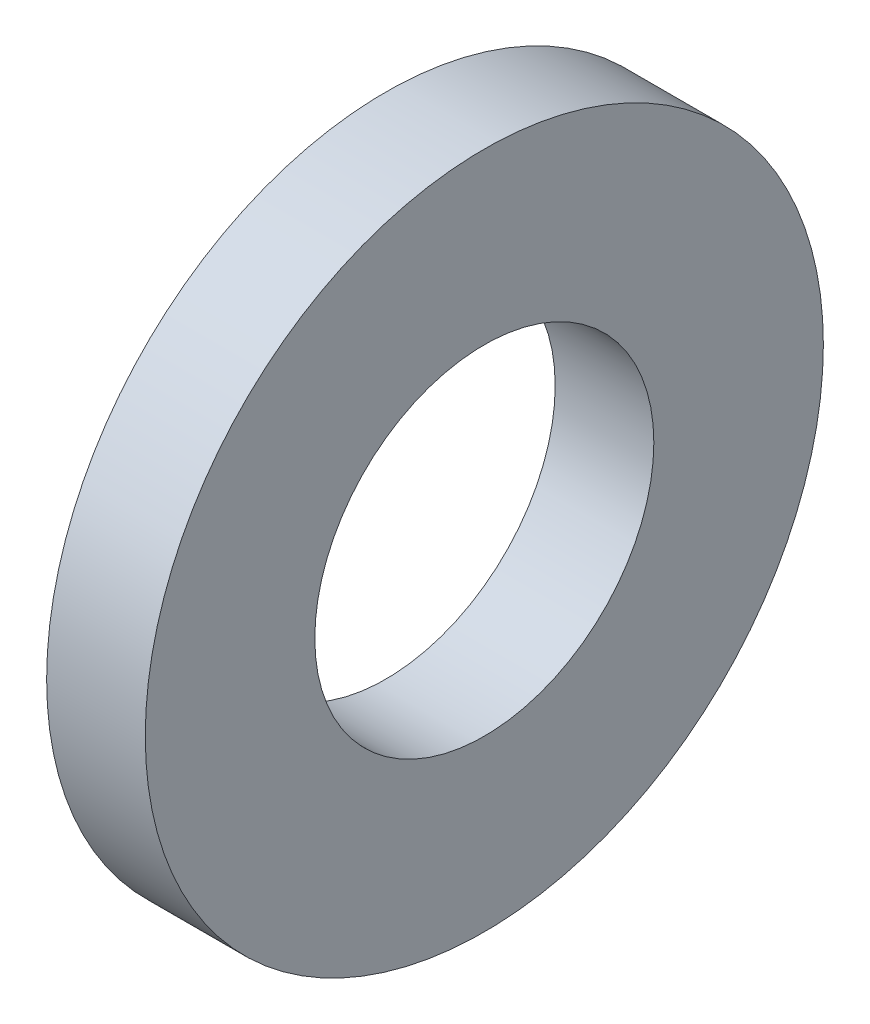
ISO-10303-21;
HEADER;
FILE_DESCRIPTION(('STEP AP214'),'2;1');
FILE_NAME('part.step','',(''),(''),'','','');
FILE_SCHEMA(('AUTOMOTIVE_DESIGN { 1 0 10303 214 1 1 1 1 }'));
ENDSEC;
DATA;
#1=APPLICATION_CONTEXT('core data for automotive mechanical design processes');
#2=APPLICATION_PROTOCOL_DEFINITION('international standard','automotive_design',2000,#1);
#3=PRODUCT_CONTEXT('',#1,'mechanical');
#4=PRODUCT('Part','Part','',(#3));
#5=PRODUCT_RELATED_PRODUCT_CATEGORY('part','',(#4));
#6=PRODUCT_DEFINITION_FORMATION('','',#4);
#7=PRODUCT_DEFINITION_CONTEXT('part definition',#1,'design');
#8=PRODUCT_DEFINITION('design','',#6,#7);
#9=PRODUCT_DEFINITION_SHAPE('','',#8);
#10=(LENGTH_UNIT() NAMED_UNIT(*) SI_UNIT(.MILLI.,.METRE.));
#11=(NAMED_UNIT(*) PLANE_ANGLE_UNIT() SI_UNIT($,.RADIAN.));
#12=(NAMED_UNIT(*) SI_UNIT($,.STERADIAN.) SOLID_ANGLE_UNIT());
#13=UNCERTAINTY_MEASURE_WITH_UNIT(LENGTH_MEASURE(1.E-05),#10,'distance_accuracy_value','');
#14=(GEOMETRIC_REPRESENTATION_CONTEXT(3) GLOBAL_UNCERTAINTY_ASSIGNED_CONTEXT((#13)) GLOBAL_UNIT_ASSIGNED_CONTEXT((#10,
#11,#12)) REPRESENTATION_CONTEXT('',''));
#15=CARTESIAN_POINT('',(0.,0.,0.));
#16=DIRECTION('',(0.,0.,1.));
#17=DIRECTION('',(1.,0.,0.));
#18=AXIS2_PLACEMENT_3D('',#15,#16,#17);
#19=CARTESIAN_POINT('',(1.6,0.,0.));
#20=DIRECTION('',(1.,0.,0.));
#21=DIRECTION('',(0.,0.,-1.));
#22=AXIS2_PLACEMENT_3D('',#19,#20,#21);
#23=PLANE('',#22);
#24=CARTESIAN_POINT('',(1.6,0.,0.));
#25=DIRECTION('',(1.,0.,0.));
#26=DIRECTION('',(0.,0.,-1.));
#27=AXIS2_PLACEMENT_3D('',#24,#25,#26);
#28=CIRCLE('',#27,5.5);
#29=CARTESIAN_POINT('',(1.6,0.,-5.5));
#30=VERTEX_POINT('',#29);
#31=EDGE_CURVE('E10',#30,#30,#28,.T.);
#32=ORIENTED_EDGE('',*,*,#31,.T.);
#33=EDGE_LOOP('',(#32));
#34=FACE_BOUND('',#33,.T.);
#35=CARTESIAN_POINT('',(1.6,0.,0.));
#36=DIRECTION('',(1.,0.,0.));
#37=DIRECTION('',(0.,0.,-1.));
#38=AXIS2_PLACEMENT_3D('',#35,#36,#37);
#39=CIRCLE('',#38,2.75);
#40=CARTESIAN_POINT('',(1.6,0.,-2.75));
#41=VERTEX_POINT('',#40);
#42=EDGE_CURVE('E41',#41,#41,#39,.T.);
#43=ORIENTED_EDGE('',*,*,#42,.F.);
#44=EDGE_LOOP('',(#43));
#45=FACE_BOUND('',#44,.T.);
#46=ADVANCED_FACE('F30',(#34,#45),#23,.T.);
#47=CARTESIAN_POINT('',(0.,0.,0.));
#48=DIRECTION('',(1.,0.,0.));
#49=DIRECTION('',(0.,0.,-1.));
#50=AXIS2_PLACEMENT_3D('',#47,#48,#49);
#51=PLANE('',#50);
#52=CARTESIAN_POINT('',(0.,0.,0.));
#53=DIRECTION('',(1.,0.,0.));
#54=DIRECTION('',(0.,0.,-1.));
#55=AXIS2_PLACEMENT_3D('',#52,#53,#54);
#56=CIRCLE('',#55,5.5);
#57=CARTESIAN_POINT('',(0.,0.,-5.5));
#58=VERTEX_POINT('',#57);
#59=EDGE_CURVE('E34',#58,#58,#56,.T.);
#60=ORIENTED_EDGE('',*,*,#59,.F.);
#61=EDGE_LOOP('',(#60));
#62=FACE_BOUND('',#61,.T.);
#63=CARTESIAN_POINT('',(0.,0.,0.));
#64=DIRECTION('',(1.,0.,0.));
#65=DIRECTION('',(0.,0.,-1.));
#66=AXIS2_PLACEMENT_3D('',#63,#64,#65);
#67=CIRCLE('',#66,2.75);
#68=CARTESIAN_POINT('',(0.,0.,-2.75));
#69=VERTEX_POINT('',#68);
#70=EDGE_CURVE('E43',#69,#69,#67,.T.);
#71=ORIENTED_EDGE('',*,*,#70,.T.);
#72=EDGE_LOOP('',(#71));
#73=FACE_BOUND('',#72,.T.);
#74=ADVANCED_FACE('F53',(#62,#73),#51,.F.);
#75=CARTESIAN_POINT('',(1.6,0.,0.));
#76=DIRECTION('',(-1.,0.,0.));
#77=DIRECTION('',(0.,0.,1.));
#78=AXIS2_PLACEMENT_3D('',#75,#76,#77);
#79=CYLINDRICAL_SURFACE('',#78,5.5);
#80=ORIENTED_EDGE('',*,*,#31,.F.);
#81=EDGE_LOOP('',(#80));
#82=FACE_BOUND('',#81,.T.);
#83=ORIENTED_EDGE('',*,*,#59,.T.);
#84=EDGE_LOOP('',(#83));
#85=FACE_BOUND('',#84,.T.);
#86=ADVANCED_FACE('F32',(#82,#85),#79,.T.);
#87=CARTESIAN_POINT('',(1.6,0.,0.));
#88=DIRECTION('',(-1.,0.,0.));
#89=DIRECTION('',(0.,0.,1.));
#90=AXIS2_PLACEMENT_3D('',#87,#88,#89);
#91=CYLINDRICAL_SURFACE('',#90,2.75);
#92=ORIENTED_EDGE('',*,*,#42,.T.);
#93=EDGE_LOOP('',(#92));
#94=FACE_BOUND('',#93,.T.);
#95=ORIENTED_EDGE('',*,*,#70,.F.);
#96=EDGE_LOOP('',(#95));
#97=FACE_BOUND('',#96,.T.);
#98=ADVANCED_FACE('F49',(#94,#97),#91,.F.);
#99=CLOSED_SHELL('',(#46,#74,#86,#98));
#100=MANIFOLD_SOLID_BREP('B2',#99);
#101=ADVANCED_BREP_SHAPE_REPRESENTATION('',(#18,#100),#14);
#102=SHAPE_DEFINITION_REPRESENTATION(#9,#101);
ENDSEC;
END-ISO-10303-21;
